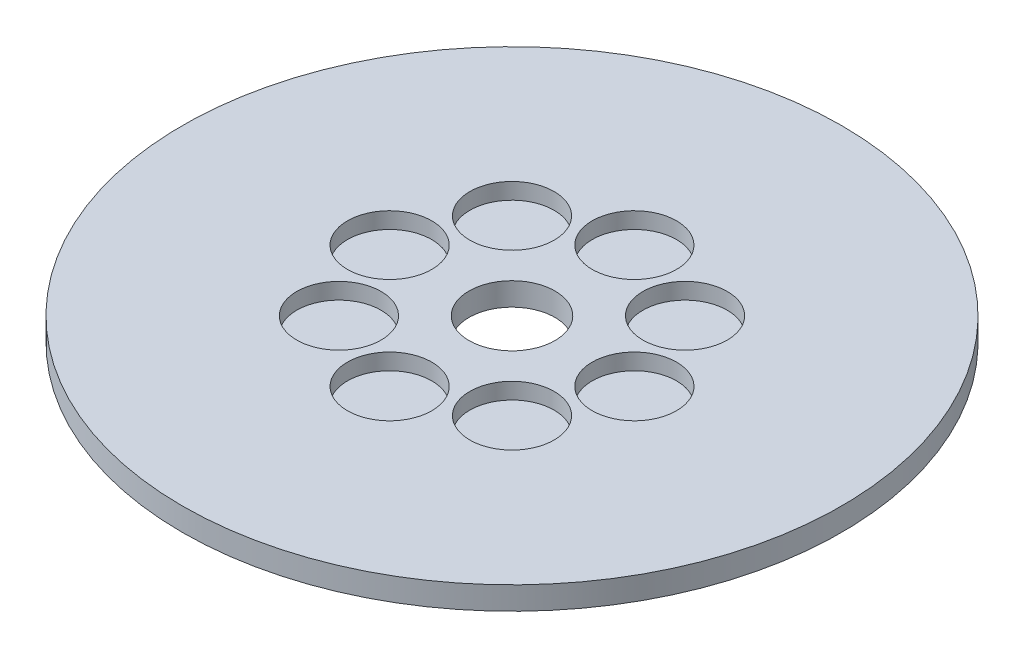
ISO-10303-21;
HEADER;
FILE_DESCRIPTION(('STEP AP214'),'2;1');
FILE_NAME('part.step','',(''),(''),'','','');
FILE_SCHEMA(('AUTOMOTIVE_DESIGN { 1 0 10303 214 1 1 1 1 }'));
ENDSEC;
DATA;
#1=APPLICATION_CONTEXT('core data for automotive mechanical design processes');
#2=APPLICATION_PROTOCOL_DEFINITION('international standard','automotive_design',2000,#1);
#3=PRODUCT_CONTEXT('',#1,'mechanical');
#4=PRODUCT('Part','Part','',(#3));
#5=PRODUCT_RELATED_PRODUCT_CATEGORY('part','',(#4));
#6=PRODUCT_DEFINITION_FORMATION('','',#4);
#7=PRODUCT_DEFINITION_CONTEXT('part definition',#1,'design');
#8=PRODUCT_DEFINITION('design','',#6,#7);
#9=PRODUCT_DEFINITION_SHAPE('','',#8);
#10=(LENGTH_UNIT() NAMED_UNIT(*) SI_UNIT(.MILLI.,.METRE.));
#11=(NAMED_UNIT(*) PLANE_ANGLE_UNIT() SI_UNIT($,.RADIAN.));
#12=(NAMED_UNIT(*) SI_UNIT($,.STERADIAN.) SOLID_ANGLE_UNIT());
#13=UNCERTAINTY_MEASURE_WITH_UNIT(LENGTH_MEASURE(1.E-05),#10,'distance_accuracy_value','');
#14=(GEOMETRIC_REPRESENTATION_CONTEXT(3) GLOBAL_UNCERTAINTY_ASSIGNED_CONTEXT((#13)) GLOBAL_UNIT_ASSIGNED_CONTEXT((#10,
#11,#12)) REPRESENTATION_CONTEXT('',''));
#15=CARTESIAN_POINT('',(0.,0.,0.));
#16=DIRECTION('',(0.,0.,1.));
#17=DIRECTION('',(1.,0.,0.));
#18=AXIS2_PLACEMENT_3D('',#15,#16,#17);
#19=CARTESIAN_POINT('',(0.,4.,0.));
#20=DIRECTION('',(0.,-1.,0.));
#21=DIRECTION('',(0.,0.,-1.));
#22=AXIS2_PLACEMENT_3D('',#19,#20,#21);
#23=CYLINDRICAL_SURFACE('',#22,57.5);
#24=CARTESIAN_POINT('',(0.,4.,0.));
#25=DIRECTION('',(0.,1.,0.));
#26=DIRECTION('',(0.,0.,1.));
#27=AXIS2_PLACEMENT_3D('',#24,#25,#26);
#28=CIRCLE('',#27,57.5);
#29=CARTESIAN_POINT('',(0.,4.,57.5));
#30=VERTEX_POINT('',#29);
#31=EDGE_CURVE('E10',#30,#30,#28,.T.);
#32=ORIENTED_EDGE('',*,*,#31,.F.);
#33=EDGE_LOOP('',(#32));
#34=FACE_BOUND('',#33,.T.);
#35=CARTESIAN_POINT('',(0.,0.,0.));
#36=DIRECTION('',(0.,1.,0.));
#37=DIRECTION('',(0.,0.,1.));
#38=AXIS2_PLACEMENT_3D('',#35,#36,#37);
#39=CIRCLE('',#38,57.5);
#40=CARTESIAN_POINT('',(0.,0.,57.5));
#41=VERTEX_POINT('',#40);
#42=EDGE_CURVE('E37',#41,#41,#39,.T.);
#43=ORIENTED_EDGE('',*,*,#42,.T.);
#44=EDGE_LOOP('',(#43));
#45=FACE_BOUND('',#44,.T.);
#46=ADVANCED_FACE('F40',(#34,#45),#23,.T.);
#47=CARTESIAN_POINT('',(0.,4.,0.));
#48=DIRECTION('',(0.,1.,0.));
#49=DIRECTION('',(0.,0.,1.));
#50=AXIS2_PLACEMENT_3D('',#47,#48,#49);
#51=PLANE('',#50);
#52=CARTESIAN_POINT('',(0.,4.,21.3512628072861));
#53=DIRECTION('',(0.,1.,0.));
#54=DIRECTION('',(1.,0.,0.));
#55=AXIS2_PLACEMENT_3D('',#52,#53,#54);
#56=CIRCLE('',#55,7.35653340735435);
#57=CARTESIAN_POINT('',(7.35653340735442,4.,21.3512628072861));
#58=VERTEX_POINT('',#57);
#59=EDGE_CURVE('E88',#58,#58,#56,.T.);
#60=ORIENTED_EDGE('',*,*,#59,.F.);
#61=EDGE_LOOP('',(#60));
#62=FACE_BOUND('',#61,.T.);
#63=CARTESIAN_POINT('',(15.0976227179282,4.,15.097622717928));
#64=DIRECTION('',(0.,1.,0.));
#65=DIRECTION('',(0.707106781186544,0.,-0.707106781186551));
#66=AXIS2_PLACEMENT_3D('',#63,#64,#65);
#67=CIRCLE('',#66,7.35653340735435);
#68=CARTESIAN_POINT('',(20.2994773762938,4.,9.89576805956237));
#69=VERTEX_POINT('',#68);
#70=EDGE_CURVE('E79',#69,#69,#67,.T.);
#71=ORIENTED_EDGE('',*,*,#70,.F.);
#72=EDGE_LOOP('',(#71));
#73=FACE_BOUND('',#72,.T.);
#74=CARTESIAN_POINT('',(21.3512628072861,4.,0.));
#75=DIRECTION('',(0.,1.,0.));
#76=DIRECTION('',(0.,0.,-1.));
#77=AXIS2_PLACEMENT_3D('',#74,#75,#76);
#78=CIRCLE('',#77,7.35653340735435);
#79=CARTESIAN_POINT('',(21.3512628072861,4.,-7.35653340735435));
#80=VERTEX_POINT('',#79);
#81=EDGE_CURVE('E74',#80,#80,#78,.T.);
#82=ORIENTED_EDGE('',*,*,#81,.F.);
#83=EDGE_LOOP('',(#82));
#84=FACE_BOUND('',#83,.T.);
#85=CARTESIAN_POINT('',(15.097622717928,4.,-15.0976227179282));
#86=DIRECTION('',(0.,1.,0.));
#87=DIRECTION('',(-0.707106781186554,0.,-0.707106781186541));
#88=AXIS2_PLACEMENT_3D('',#85,#86,#87);
#89=CIRCLE('',#88,7.35653340735435);
#90=CARTESIAN_POINT('',(9.89576805956229,4.,-20.2994773762938));
#91=VERTEX_POINT('',#90);
#92=EDGE_CURVE('E70',#91,#91,#89,.T.);
#93=ORIENTED_EDGE('',*,*,#92,.F.);
#94=EDGE_LOOP('',(#93));
#95=FACE_BOUND('',#94,.T.);
#96=CARTESIAN_POINT('',(-2.23642606957124E-13,4.,-21.3512628072861));
#97=DIRECTION('',(0.,1.,0.));
#98=DIRECTION('',(-1.,0.,0.));
#99=AXIS2_PLACEMENT_3D('',#96,#97,#98);
#100=CIRCLE('',#99,7.35653340735435);
#101=CARTESIAN_POINT('',(-7.35653340735457,4.,-21.351262807286));
#102=VERTEX_POINT('',#101);
#103=EDGE_CURVE('E100',#102,#102,#100,.T.);
#104=ORIENTED_EDGE('',*,*,#103,.F.);
#105=EDGE_LOOP('',(#104));
#106=FACE_BOUND('',#105,.T.);
#107=CARTESIAN_POINT('',(-15.0976227179283,4.,-15.0976227179279));
#108=DIRECTION('',(0.,1.,0.));
#109=DIRECTION('',(-0.707106781186539,0.,0.707106781186556));
#110=AXIS2_PLACEMENT_3D('',#107,#108,#109);
#111=CIRCLE('',#110,7.35653340735435);
#112=CARTESIAN_POINT('',(-20.2994773762939,4.,-9.89576805956223));
#113=VERTEX_POINT('',#112);
#114=EDGE_CURVE('E93',#113,#113,#111,.T.);
#115=ORIENTED_EDGE('',*,*,#114,.F.);
#116=EDGE_LOOP('',(#115));
#117=FACE_BOUND('',#116,.T.);
#118=CARTESIAN_POINT('',(-15.0976227179281,4.,15.0976227179281));
#119=DIRECTION('',(0.,1.,0.));
#120=DIRECTION('',(0.707106781186549,0.,0.707106781186546));
#121=AXIS2_PLACEMENT_3D('',#118,#119,#120);
#122=CIRCLE('',#121,7.35653340735435);
#123=CARTESIAN_POINT('',(-9.89576805956244,4.,20.2994773762938));
#124=VERTEX_POINT('',#123);
#125=EDGE_CURVE('E61',#124,#124,#122,.T.);
#126=ORIENTED_EDGE('',*,*,#125,.F.);
#127=EDGE_LOOP('',(#126));
#128=FACE_BOUND('',#127,.T.);
#129=CARTESIAN_POINT('',(-21.3512628072861,4.,0.));
#130=DIRECTION('',(0.,1.,0.));
#131=DIRECTION('',(0.,0.,1.));
#132=AXIS2_PLACEMENT_3D('',#129,#130,#131);
#133=CIRCLE('',#132,7.35653340735435);
#134=CARTESIAN_POINT('',(-21.3512628072861,4.,7.35653340735435));
#135=VERTEX_POINT('',#134);
#136=EDGE_CURVE('E54',#135,#135,#133,.T.);
#137=ORIENTED_EDGE('',*,*,#136,.F.);
#138=EDGE_LOOP('',(#137));
#139=FACE_BOUND('',#138,.T.);
#140=CARTESIAN_POINT('',(0.,4.,0.));
#141=DIRECTION('',(0.,1.,0.));
#142=DIRECTION('',(0.,0.,1.));
#143=AXIS2_PLACEMENT_3D('',#140,#141,#142);
#144=CIRCLE('',#143,7.5);
#145=CARTESIAN_POINT('',(0.,4.,7.5));
#146=VERTEX_POINT('',#145);
#147=EDGE_CURVE('E50',#146,#146,#144,.T.);
#148=ORIENTED_EDGE('',*,*,#147,.F.);
#149=EDGE_LOOP('',(#148));
#150=FACE_BOUND('',#149,.T.);
#151=ORIENTED_EDGE('',*,*,#31,.T.);
#152=EDGE_LOOP('',(#151));
#153=FACE_BOUND('',#152,.T.);
#154=ADVANCED_FACE('F115',(#62,#73,#84,#95,#106,#117,#128,#139,#150,#153),#51,.T.);
#155=CARTESIAN_POINT('',(0.,0.,0.));
#156=DIRECTION('',(0.,1.,0.));
#157=DIRECTION('',(0.,0.,1.));
#158=AXIS2_PLACEMENT_3D('',#155,#156,#157);
#159=PLANE('',#158);
#160=CARTESIAN_POINT('',(0.,0.,0.));
#161=DIRECTION('',(0.,1.,0.));
#162=DIRECTION('',(0.,0.,1.));
#163=AXIS2_PLACEMENT_3D('',#160,#161,#162);
#164=CIRCLE('',#163,7.5);
#165=CARTESIAN_POINT('',(0.,0.,7.5));
#166=VERTEX_POINT('',#165);
#167=EDGE_CURVE('E47',#166,#166,#164,.T.);
#168=ORIENTED_EDGE('',*,*,#167,.T.);
#169=EDGE_LOOP('',(#168));
#170=FACE_BOUND('',#169,.T.);
#171=ORIENTED_EDGE('',*,*,#42,.F.);
#172=EDGE_LOOP('',(#171));
#173=FACE_BOUND('',#172,.T.);
#174=ADVANCED_FACE('F113',(#170,#173),#159,.F.);
#175=CARTESIAN_POINT('',(0.,4.,0.));
#176=DIRECTION('',(0.,-1.,0.));
#177=DIRECTION('',(0.,0.,-1.));
#178=AXIS2_PLACEMENT_3D('',#175,#176,#177);
#179=CYLINDRICAL_SURFACE('',#178,7.5);
#180=ORIENTED_EDGE('',*,*,#147,.T.);
#181=EDGE_LOOP('',(#180));
#182=FACE_BOUND('',#181,.T.);
#183=ORIENTED_EDGE('',*,*,#167,.F.);
#184=EDGE_LOOP('',(#183));
#185=FACE_BOUND('',#184,.T.);
#186=ADVANCED_FACE('F127',(#182,#185),#179,.F.);
#187=CARTESIAN_POINT('',(-21.3512628072861,1.16297199239627,0.));
#188=DIRECTION('',(0.,1.,0.));
#189=DIRECTION('',(0.,0.,1.));
#190=AXIS2_PLACEMENT_3D('',#187,#188,#189);
#191=CYLINDRICAL_SURFACE('',#190,7.35653340735435);
#192=CARTESIAN_POINT('',(-21.3512628072861,1.16297199239627,0.));
#193=DIRECTION('',(0.,1.,0.));
#194=DIRECTION('',(0.,0.,1.));
#195=AXIS2_PLACEMENT_3D('',#192,#193,#194);
#196=CIRCLE('',#195,7.35653340735435);
#197=CARTESIAN_POINT('',(-21.3512628072861,1.16297199239627,7.35653340735435));
#198=VERTEX_POINT('',#197);
#199=EDGE_CURVE('E55',#198,#198,#196,.T.);
#200=ORIENTED_EDGE('',*,*,#199,.F.);
#201=EDGE_LOOP('',(#200));
#202=FACE_BOUND('',#201,.T.);
#203=ORIENTED_EDGE('',*,*,#136,.T.);
#204=EDGE_LOOP('',(#203));
#205=FACE_BOUND('',#204,.T.);
#206=ADVANCED_FACE('F129',(#202,#205),#191,.F.);
#207=CARTESIAN_POINT('',(-21.3512628072861,1.16297199239627,0.));
#208=DIRECTION('',(0.,1.,0.));
#209=DIRECTION('',(0.,0.,1.));
#210=AXIS2_PLACEMENT_3D('',#207,#208,#209);
#211=PLANE('',#210);
#212=ORIENTED_EDGE('',*,*,#199,.T.);
#213=EDGE_LOOP('',(#212));
#214=FACE_BOUND('',#213,.T.);
#215=ADVANCED_FACE('F157',(#214),#211,.T.);
#216=CARTESIAN_POINT('',(-15.0976227179281,1.16297199239627,15.0976227179281));
#217=DIRECTION('',(0.,1.,0.));
#218=DIRECTION('',(0.,0.,1.));
#219=AXIS2_PLACEMENT_3D('',#216,#217,#218);
#220=CYLINDRICAL_SURFACE('',#219,7.35653340735435);
#221=CARTESIAN_POINT('',(-15.0976227179281,1.16297199239627,15.0976227179281));
#222=DIRECTION('',(0.,1.,0.));
#223=DIRECTION('',(0.707106781186549,0.,0.707106781186546));
#224=AXIS2_PLACEMENT_3D('',#221,#222,#223);
#225=CIRCLE('',#224,7.35653340735435);
#226=CARTESIAN_POINT('',(-9.89576805956244,1.16297199239627,20.2994773762938));
#227=VERTEX_POINT('',#226);
#228=EDGE_CURVE('E59',#227,#227,#225,.T.);
#229=ORIENTED_EDGE('',*,*,#228,.F.);
#230=EDGE_LOOP('',(#229));
#231=FACE_BOUND('',#230,.T.);
#232=ORIENTED_EDGE('',*,*,#125,.T.);
#233=EDGE_LOOP('',(#232));
#234=FACE_BOUND('',#233,.T.);
#235=ADVANCED_FACE('F170',(#231,#234),#220,.F.);
#236=CARTESIAN_POINT('',(-15.0976227179281,1.16297199239627,15.0976227179281));
#237=DIRECTION('',(0.,1.,0.));
#238=DIRECTION('',(0.707106781186549,0.,0.707106781186546));
#239=AXIS2_PLACEMENT_3D('',#236,#237,#238);
#240=PLANE('',#239);
#241=ORIENTED_EDGE('',*,*,#228,.T.);
#242=EDGE_LOOP('',(#241));
#243=FACE_BOUND('',#242,.T.);
#244=ADVANCED_FACE('F182',(#243),#240,.T.);
#245=CARTESIAN_POINT('',(-15.0976227179283,1.16297199239627,-15.0976227179279));
#246=DIRECTION('',(0.,1.,0.));
#247=DIRECTION('',(0.,0.,1.));
#248=AXIS2_PLACEMENT_3D('',#245,#246,#247);
#249=CYLINDRICAL_SURFACE('',#248,7.35653340735435);
#250=CARTESIAN_POINT('',(-15.0976227179283,1.16297199239627,-15.0976227179279));
#251=DIRECTION('',(0.,1.,0.));
#252=DIRECTION('',(-0.707106781186539,0.,0.707106781186556));
#253=AXIS2_PLACEMENT_3D('',#250,#251,#252);
#254=CIRCLE('',#253,7.35653340735435);
#255=CARTESIAN_POINT('',(-20.2994773762939,1.16297199239627,-9.89576805956223));
#256=VERTEX_POINT('',#255);
#257=EDGE_CURVE('E94',#256,#256,#254,.T.);
#258=ORIENTED_EDGE('',*,*,#257,.F.);
#259=EDGE_LOOP('',(#258));
#260=FACE_BOUND('',#259,.T.);
#261=ORIENTED_EDGE('',*,*,#114,.T.);
#262=EDGE_LOOP('',(#261));
#263=FACE_BOUND('',#262,.T.);
#264=ADVANCED_FACE('F189',(#260,#263),#249,.F.);
#265=CARTESIAN_POINT('',(-15.0976227179283,1.16297199239627,-15.0976227179279));
#266=DIRECTION('',(0.,1.,0.));
#267=DIRECTION('',(-0.707106781186539,0.,0.707106781186556));
#268=AXIS2_PLACEMENT_3D('',#265,#266,#267);
#269=PLANE('',#268);
#270=ORIENTED_EDGE('',*,*,#257,.T.);
#271=EDGE_LOOP('',(#270));
#272=FACE_BOUND('',#271,.T.);
#273=ADVANCED_FACE('F107',(#272),#269,.T.);
#274=CARTESIAN_POINT('',(-2.23642606957124E-13,1.16297199239627,-21.3512628072861));
#275=DIRECTION('',(0.,1.,0.));
#276=DIRECTION('',(0.,0.,1.));
#277=AXIS2_PLACEMENT_3D('',#274,#275,#276);
#278=CYLINDRICAL_SURFACE('',#277,7.35653340735435);
#279=CARTESIAN_POINT('',(-2.23642606957124E-13,1.16297199239627,-21.3512628072861));
#280=DIRECTION('',(0.,1.,0.));
#281=DIRECTION('',(-1.,0.,0.));
#282=AXIS2_PLACEMENT_3D('',#279,#280,#281);
#283=CIRCLE('',#282,7.35653340735435);
#284=CARTESIAN_POINT('',(-7.35653340735457,1.16297199239627,-21.351262807286));
#285=VERTEX_POINT('',#284);
#286=EDGE_CURVE('E72',#285,#285,#283,.T.);
#287=ORIENTED_EDGE('',*,*,#286,.F.);
#288=EDGE_LOOP('',(#287));
#289=FACE_BOUND('',#288,.T.);
#290=ORIENTED_EDGE('',*,*,#103,.T.);
#291=EDGE_LOOP('',(#290));
#292=FACE_BOUND('',#291,.T.);
#293=ADVANCED_FACE('F104',(#289,#292),#278,.F.);
#294=CARTESIAN_POINT('',(-2.23642606957124E-13,1.16297199239627,-21.3512628072861));
#295=DIRECTION('',(0.,1.,0.));
#296=DIRECTION('',(-1.,0.,0.));
#297=AXIS2_PLACEMENT_3D('',#294,#295,#296);
#298=PLANE('',#297);
#299=ORIENTED_EDGE('',*,*,#286,.T.);
#300=EDGE_LOOP('',(#299));
#301=FACE_BOUND('',#300,.T.);
#302=ADVANCED_FACE('F103',(#301),#298,.T.);
#303=CARTESIAN_POINT('',(15.097622717928,1.16297199239627,-15.0976227179282));
#304=DIRECTION('',(0.,1.,0.));
#305=DIRECTION('',(0.,0.,1.));
#306=AXIS2_PLACEMENT_3D('',#303,#304,#305);
#307=CYLINDRICAL_SURFACE('',#306,7.35653340735435);
#308=CARTESIAN_POINT('',(15.097622717928,1.16297199239627,-15.0976227179282));
#309=DIRECTION('',(0.,1.,0.));
#310=DIRECTION('',(-0.707106781186554,0.,-0.707106781186541));
#311=AXIS2_PLACEMENT_3D('',#308,#309,#310);
#312=CIRCLE('',#311,7.35653340735435);
#313=CARTESIAN_POINT('',(9.89576805956229,1.16297199239627,-20.2994773762938));
#314=VERTEX_POINT('',#313);
#315=EDGE_CURVE('E69',#314,#314,#312,.T.);
#316=ORIENTED_EDGE('',*,*,#315,.F.);
#317=EDGE_LOOP('',(#316));
#318=FACE_BOUND('',#317,.T.);
#319=ORIENTED_EDGE('',*,*,#92,.T.);
#320=EDGE_LOOP('',(#319));
#321=FACE_BOUND('',#320,.T.);
#322=ADVANCED_FACE('F219',(#318,#321),#307,.F.);
#323=CARTESIAN_POINT('',(15.097622717928,1.16297199239627,-15.0976227179282));
#324=DIRECTION('',(0.,1.,0.));
#325=DIRECTION('',(-0.707106781186554,0.,-0.707106781186541));
#326=AXIS2_PLACEMENT_3D('',#323,#324,#325);
#327=PLANE('',#326);
#328=ORIENTED_EDGE('',*,*,#315,.T.);
#329=EDGE_LOOP('',(#328));
#330=FACE_BOUND('',#329,.T.);
#331=ADVANCED_FACE('F227',(#330),#327,.T.);
#332=CARTESIAN_POINT('',(21.3512628072861,1.16297199239627,0.));
#333=DIRECTION('',(0.,1.,0.));
#334=DIRECTION('',(0.,0.,1.));
#335=AXIS2_PLACEMENT_3D('',#332,#333,#334);
#336=CYLINDRICAL_SURFACE('',#335,7.35653340735435);
#337=CARTESIAN_POINT('',(21.3512628072861,1.16297199239627,0.));
#338=DIRECTION('',(0.,1.,0.));
#339=DIRECTION('',(0.,0.,-1.));
#340=AXIS2_PLACEMENT_3D('',#337,#338,#339);
#341=CIRCLE('',#340,7.35653340735435);
#342=CARTESIAN_POINT('',(21.3512628072861,1.16297199239627,-7.35653340735435));
#343=VERTEX_POINT('',#342);
#344=EDGE_CURVE('E80',#343,#343,#341,.T.);
#345=ORIENTED_EDGE('',*,*,#344,.F.);
#346=EDGE_LOOP('',(#345));
#347=FACE_BOUND('',#346,.T.);
#348=ORIENTED_EDGE('',*,*,#81,.T.);
#349=EDGE_LOOP('',(#348));
#350=FACE_BOUND('',#349,.T.);
#351=ADVANCED_FACE('F240',(#347,#350),#336,.F.);
#352=CARTESIAN_POINT('',(21.3512628072861,1.16297199239627,0.));
#353=DIRECTION('',(0.,1.,0.));
#354=DIRECTION('',(0.,0.,-1.));
#355=AXIS2_PLACEMENT_3D('',#352,#353,#354);
#356=PLANE('',#355);
#357=ORIENTED_EDGE('',*,*,#344,.T.);
#358=EDGE_LOOP('',(#357));
#359=FACE_BOUND('',#358,.T.);
#360=ADVANCED_FACE('F246',(#359),#356,.T.);
#361=CARTESIAN_POINT('',(15.0976227179282,1.16297199239627,15.097622717928));
#362=DIRECTION('',(0.,1.,0.));
#363=DIRECTION('',(0.,0.,1.));
#364=AXIS2_PLACEMENT_3D('',#361,#362,#363);
#365=CYLINDRICAL_SURFACE('',#364,7.35653340735435);
#366=CARTESIAN_POINT('',(15.0976227179282,1.16297199239627,15.097622717928));
#367=DIRECTION('',(0.,1.,0.));
#368=DIRECTION('',(0.707106781186544,0.,-0.707106781186551));
#369=AXIS2_PLACEMENT_3D('',#366,#367,#368);
#370=CIRCLE('',#369,7.35653340735435);
#371=CARTESIAN_POINT('',(20.2994773762938,1.16297199239627,9.89576805956237));
#372=VERTEX_POINT('',#371);
#373=EDGE_CURVE('E82',#372,#372,#370,.T.);
#374=ORIENTED_EDGE('',*,*,#373,.F.);
#375=EDGE_LOOP('',(#374));
#376=FACE_BOUND('',#375,.T.);
#377=ORIENTED_EDGE('',*,*,#70,.T.);
#378=EDGE_LOOP('',(#377));
#379=FACE_BOUND('',#378,.T.);
#380=ADVANCED_FACE('F254',(#376,#379),#365,.F.);
#381=CARTESIAN_POINT('',(15.0976227179282,1.16297199239627,15.097622717928));
#382=DIRECTION('',(0.,1.,0.));
#383=DIRECTION('',(0.707106781186544,0.,-0.707106781186551));
#384=AXIS2_PLACEMENT_3D('',#381,#382,#383);
#385=PLANE('',#384);
#386=ORIENTED_EDGE('',*,*,#373,.T.);
#387=EDGE_LOOP('',(#386));
#388=FACE_BOUND('',#387,.T.);
#389=ADVANCED_FACE('F262',(#388),#385,.T.);
#390=CARTESIAN_POINT('',(0.,1.16297199239627,21.3512628072861));
#391=DIRECTION('',(0.,1.,0.));
#392=DIRECTION('',(0.,0.,1.));
#393=AXIS2_PLACEMENT_3D('',#390,#391,#392);
#394=CYLINDRICAL_SURFACE('',#393,7.35653340735435);
#395=CARTESIAN_POINT('',(0.,1.16297199239627,21.3512628072861));
#396=DIRECTION('',(0.,1.,0.));
#397=DIRECTION('',(1.,0.,0.));
#398=AXIS2_PLACEMENT_3D('',#395,#396,#397);
#399=CIRCLE('',#398,7.35653340735435);
#400=CARTESIAN_POINT('',(7.35653340735442,1.16297199239627,21.3512628072861));
#401=VERTEX_POINT('',#400);
#402=EDGE_CURVE('E63',#401,#401,#399,.T.);
#403=ORIENTED_EDGE('',*,*,#402,.F.);
#404=EDGE_LOOP('',(#403));
#405=FACE_BOUND('',#404,.T.);
#406=ORIENTED_EDGE('',*,*,#59,.T.);
#407=EDGE_LOOP('',(#406));
#408=FACE_BOUND('',#407,.T.);
#409=ADVANCED_FACE('F272',(#405,#408),#394,.F.);
#410=CARTESIAN_POINT('',(0.,1.16297199239627,21.3512628072861));
#411=DIRECTION('',(0.,1.,0.));
#412=DIRECTION('',(1.,0.,0.));
#413=AXIS2_PLACEMENT_3D('',#410,#411,#412);
#414=PLANE('',#413);
#415=ORIENTED_EDGE('',*,*,#402,.T.);
#416=EDGE_LOOP('',(#415));
#417=FACE_BOUND('',#416,.T.);
#418=ADVANCED_FACE('F285',(#417),#414,.T.);
#419=CLOSED_SHELL('',(#46,#154,#174,#186,#206,#215,#235,#244,#264,#273,#293,#302,#322,#331,#351,
#360,#380,#389,#409,#418));
#420=MANIFOLD_SOLID_BREP('B2',#419);
#421=ADVANCED_BREP_SHAPE_REPRESENTATION('',(#18,#420),#14);
#422=SHAPE_DEFINITION_REPRESENTATION(#9,#421);
ENDSEC;
END-ISO-10303-21;
